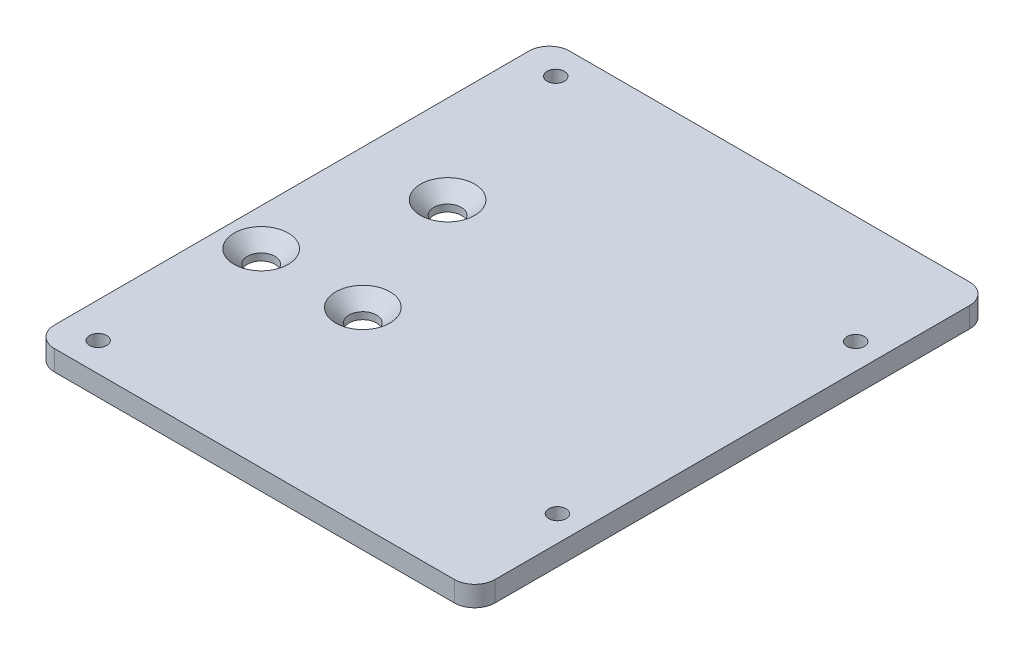
ISO-10303-21;
HEADER;
FILE_DESCRIPTION(('STEP AP214'),'2;1');
FILE_NAME('part.step','',(''),(''),'','','');
FILE_SCHEMA(('AUTOMOTIVE_DESIGN { 1 0 10303 214 1 1 1 1 }'));
ENDSEC;
DATA;
#1=APPLICATION_CONTEXT('core data for automotive mechanical design processes');
#2=APPLICATION_PROTOCOL_DEFINITION('international standard','automotive_design',2000,#1);
#3=PRODUCT_CONTEXT('',#1,'mechanical');
#4=PRODUCT('Part','Part','',(#3));
#5=PRODUCT_RELATED_PRODUCT_CATEGORY('part','',(#4));
#6=PRODUCT_DEFINITION_FORMATION('','',#4);
#7=PRODUCT_DEFINITION_CONTEXT('part definition',#1,'design');
#8=PRODUCT_DEFINITION('design','',#6,#7);
#9=PRODUCT_DEFINITION_SHAPE('','',#8);
#10=(LENGTH_UNIT() NAMED_UNIT(*) SI_UNIT(.MILLI.,.METRE.));
#11=(NAMED_UNIT(*) PLANE_ANGLE_UNIT() SI_UNIT($,.RADIAN.));
#12=(NAMED_UNIT(*) SI_UNIT($,.STERADIAN.) SOLID_ANGLE_UNIT());
#13=UNCERTAINTY_MEASURE_WITH_UNIT(LENGTH_MEASURE(1.E-05),#10,'distance_accuracy_value','');
#14=(GEOMETRIC_REPRESENTATION_CONTEXT(3) GLOBAL_UNCERTAINTY_ASSIGNED_CONTEXT((#13)) GLOBAL_UNIT_ASSIGNED_CONTEXT((#10,
#11,#12)) REPRESENTATION_CONTEXT('',''));
#15=CARTESIAN_POINT('',(0.,0.,0.));
#16=DIRECTION('',(0.,0.,1.));
#17=DIRECTION('',(1.,0.,0.));
#18=AXIS2_PLACEMENT_3D('',#15,#16,#17);
#19=CARTESIAN_POINT('',(32.5,3.,38.));
#20=DIRECTION('',(-1.,0.,0.));
#21=DIRECTION('',(0.,0.,1.));
#22=AXIS2_PLACEMENT_3D('',#19,#20,#21);
#23=PLANE('',#22);
#24=DIRECTION('',(0.,0.,-1.));
#25=VECTOR('',#24,1.);
#26=CARTESIAN_POINT('',(32.5,0.,38.));
#27=LINE('',#26,#25);
#28=CARTESIAN_POINT('',(32.5,0.,35.));
#29=VERTEX_POINT('',#28);
#30=CARTESIAN_POINT('',(32.5,0.,-35.));
#31=VERTEX_POINT('',#30);
#32=EDGE_CURVE('E208',#29,#31,#27,.T.);
#33=ORIENTED_EDGE('',*,*,#32,.T.);
#34=DIRECTION('',(0.,-1.,0.));
#35=VECTOR('',#34,1.);
#36=CARTESIAN_POINT('',(32.5,3.,-35.));
#37=LINE('',#36,#35);
#38=CARTESIAN_POINT('',(32.5,3.,-35.));
#39=VERTEX_POINT('',#38);
#40=EDGE_CURVE('E11',#31,#39,#37,.F.);
#41=ORIENTED_EDGE('',*,*,#40,.T.);
#42=DIRECTION('',(0.,0.,-1.));
#43=VECTOR('',#42,1.);
#44=CARTESIAN_POINT('',(32.5,3.,38.));
#45=LINE('',#44,#43);
#46=CARTESIAN_POINT('',(32.5,3.,35.));
#47=VERTEX_POINT('',#46);
#48=EDGE_CURVE('E129',#47,#39,#45,.T.);
#49=ORIENTED_EDGE('',*,*,#48,.F.);
#50=DIRECTION('',(0.,-1.,0.));
#51=VECTOR('',#50,1.);
#52=CARTESIAN_POINT('',(32.5,3.,35.));
#53=LINE('',#52,#51);
#54=EDGE_CURVE('E44',#47,#29,#53,.T.);
#55=ORIENTED_EDGE('',*,*,#54,.T.);
#56=EDGE_LOOP('',(#33,#41,#49,#55));
#57=FACE_BOUND('',#56,.T.);
#58=ADVANCED_FACE('F35',(#57),#23,.F.);
#59=CARTESIAN_POINT('',(-32.5,3.,-38.));
#60=DIRECTION('',(0.,0.,1.));
#61=DIRECTION('',(1.,0.,0.));
#62=AXIS2_PLACEMENT_3D('',#59,#60,#61);
#63=PLANE('',#62);
#64=DIRECTION('',(-1.,0.,0.));
#65=VECTOR('',#64,1.);
#66=CARTESIAN_POINT('',(-32.5,0.,-38.));
#67=LINE('',#66,#65);
#68=CARTESIAN_POINT('',(29.5,0.,-38.));
#69=VERTEX_POINT('',#68);
#70=CARTESIAN_POINT('',(-29.5,0.,-38.));
#71=VERTEX_POINT('',#70);
#72=EDGE_CURVE('E134',#69,#71,#67,.T.);
#73=ORIENTED_EDGE('',*,*,#72,.T.);
#74=DIRECTION('',(0.,-1.,0.));
#75=VECTOR('',#74,1.);
#76=CARTESIAN_POINT('',(-29.5,3.,-38.));
#77=LINE('',#76,#75);
#78=CARTESIAN_POINT('',(-29.5,3.,-38.));
#79=VERTEX_POINT('',#78);
#80=EDGE_CURVE('E52',#71,#79,#77,.F.);
#81=ORIENTED_EDGE('',*,*,#80,.T.);
#82=DIRECTION('',(-1.,0.,0.));
#83=VECTOR('',#82,1.);
#84=CARTESIAN_POINT('',(-32.5,3.,-38.));
#85=LINE('',#84,#83);
#86=CARTESIAN_POINT('',(29.5,3.,-38.));
#87=VERTEX_POINT('',#86);
#88=EDGE_CURVE('E132',#87,#79,#85,.T.);
#89=ORIENTED_EDGE('',*,*,#88,.F.);
#90=DIRECTION('',(0.,-1.,0.));
#91=VECTOR('',#90,1.);
#92=CARTESIAN_POINT('',(29.5,3.,-38.));
#93=LINE('',#92,#91);
#94=EDGE_CURVE('E153',#87,#69,#93,.T.);
#95=ORIENTED_EDGE('',*,*,#94,.T.);
#96=EDGE_LOOP('',(#73,#81,#89,#95));
#97=FACE_BOUND('',#96,.T.);
#98=ADVANCED_FACE('F218',(#97),#63,.F.);
#99=CARTESIAN_POINT('',(-32.5,3.,38.));
#100=DIRECTION('',(1.,0.,0.));
#101=DIRECTION('',(0.,0.,-1.));
#102=AXIS2_PLACEMENT_3D('',#99,#100,#101);
#103=PLANE('',#102);
#104=DIRECTION('',(0.,0.,1.));
#105=VECTOR('',#104,1.);
#106=CARTESIAN_POINT('',(-32.5,0.,38.));
#107=LINE('',#106,#105);
#108=CARTESIAN_POINT('',(-32.5,0.,-35.));
#109=VERTEX_POINT('',#108);
#110=CARTESIAN_POINT('',(-32.5,0.,35.));
#111=VERTEX_POINT('',#110);
#112=EDGE_CURVE('E130',#109,#111,#107,.T.);
#113=ORIENTED_EDGE('',*,*,#112,.T.);
#114=DIRECTION('',(0.,-1.,0.));
#115=VECTOR('',#114,1.);
#116=CARTESIAN_POINT('',(-32.5,3.,35.));
#117=LINE('',#116,#115);
#118=CARTESIAN_POINT('',(-32.5,3.,35.));
#119=VERTEX_POINT('',#118);
#120=EDGE_CURVE('E108',#111,#119,#117,.F.);
#121=ORIENTED_EDGE('',*,*,#120,.T.);
#122=DIRECTION('',(0.,0.,1.));
#123=VECTOR('',#122,1.);
#124=CARTESIAN_POINT('',(-32.5,3.,38.));
#125=LINE('',#124,#123);
#126=CARTESIAN_POINT('',(-32.5,3.,-35.));
#127=VERTEX_POINT('',#126);
#128=EDGE_CURVE('E212',#127,#119,#125,.T.);
#129=ORIENTED_EDGE('',*,*,#128,.F.);
#130=DIRECTION('',(0.,-1.,0.));
#131=VECTOR('',#130,1.);
#132=CARTESIAN_POINT('',(-32.5,3.,-35.));
#133=LINE('',#132,#131);
#134=EDGE_CURVE('E113',#127,#109,#133,.T.);
#135=ORIENTED_EDGE('',*,*,#134,.T.);
#136=EDGE_LOOP('',(#113,#121,#129,#135));
#137=FACE_BOUND('',#136,.T.);
#138=ADVANCED_FACE('F227',(#137),#103,.F.);
#139=CARTESIAN_POINT('',(-32.5,3.,38.));
#140=DIRECTION('',(0.,0.,-1.));
#141=DIRECTION('',(-1.,0.,0.));
#142=AXIS2_PLACEMENT_3D('',#139,#140,#141);
#143=PLANE('',#142);
#144=DIRECTION('',(1.,0.,0.));
#145=VECTOR('',#144,1.);
#146=CARTESIAN_POINT('',(-32.5,3.,38.));
#147=LINE('',#146,#145);
#148=CARTESIAN_POINT('',(-29.5,3.,38.));
#149=VERTEX_POINT('',#148);
#150=CARTESIAN_POINT('',(29.5,3.,38.));
#151=VERTEX_POINT('',#150);
#152=EDGE_CURVE('E123',#149,#151,#147,.T.);
#153=ORIENTED_EDGE('',*,*,#152,.F.);
#154=DIRECTION('',(0.,-1.,0.));
#155=VECTOR('',#154,1.);
#156=CARTESIAN_POINT('',(-29.5,3.,38.));
#157=LINE('',#156,#155);
#158=CARTESIAN_POINT('',(-29.5,0.,38.));
#159=VERTEX_POINT('',#158);
#160=EDGE_CURVE('E107',#149,#159,#157,.T.);
#161=ORIENTED_EDGE('',*,*,#160,.T.);
#162=DIRECTION('',(1.,0.,0.));
#163=VECTOR('',#162,1.);
#164=CARTESIAN_POINT('',(-32.5,0.,38.));
#165=LINE('',#164,#163);
#166=CARTESIAN_POINT('',(29.5,0.,38.));
#167=VERTEX_POINT('',#166);
#168=EDGE_CURVE('E120',#159,#167,#165,.T.);
#169=ORIENTED_EDGE('',*,*,#168,.T.);
#170=DIRECTION('',(0.,-1.,0.));
#171=VECTOR('',#170,1.);
#172=CARTESIAN_POINT('',(29.5,3.,38.));
#173=LINE('',#172,#171);
#174=EDGE_CURVE('E125',#167,#151,#173,.F.);
#175=ORIENTED_EDGE('',*,*,#174,.T.);
#176=EDGE_LOOP('',(#153,#161,#169,#175));
#177=FACE_BOUND('',#176,.T.);
#178=ADVANCED_FACE('F119',(#177),#143,.F.);
#179=CARTESIAN_POINT('',(0.,3.,0.));
#180=DIRECTION('',(0.,-1.,0.));
#181=DIRECTION('',(0.,0.,-1.));
#182=AXIS2_PLACEMENT_3D('',#179,#180,#181);
#183=PLANE('',#182);
#184=CARTESIAN_POINT('',(-12.,3.,9.99999999999997));
#185=DIRECTION('',(0.,1.,0.));
#186=DIRECTION('',(0.,0.,1.));
#187=AXIS2_PLACEMENT_3D('',#184,#185,#186);
#188=CIRCLE('',#187,4.);
#189=CARTESIAN_POINT('',(-12.,3.,14.));
#190=VERTEX_POINT('',#189);
#191=EDGE_CURVE('E184',#190,#190,#188,.T.);
#192=ORIENTED_EDGE('',*,*,#191,.F.);
#193=EDGE_LOOP('',(#192));
#194=FACE_BOUND('',#193,.T.);
#195=CARTESIAN_POINT('',(-27.,3.,9.99999999999997));
#196=DIRECTION('',(0.,1.,0.));
#197=DIRECTION('',(0.,0.,1.));
#198=AXIS2_PLACEMENT_3D('',#195,#196,#197);
#199=CIRCLE('',#198,4.);
#200=CARTESIAN_POINT('',(-27.,3.,14.));
#201=VERTEX_POINT('',#200);
#202=EDGE_CURVE('E174',#201,#201,#199,.T.);
#203=ORIENTED_EDGE('',*,*,#202,.F.);
#204=EDGE_LOOP('',(#203));
#205=FACE_BOUND('',#204,.T.);
#206=CARTESIAN_POINT('',(-19.5,3.,-10.));
#207=DIRECTION('',(0.,1.,0.));
#208=DIRECTION('',(0.,0.,1.));
#209=AXIS2_PLACEMENT_3D('',#206,#207,#208);
#210=CIRCLE('',#209,4.);
#211=CARTESIAN_POINT('',(-19.5,3.,-6.00000000000002));
#212=VERTEX_POINT('',#211);
#213=EDGE_CURVE('E171',#212,#212,#210,.T.);
#214=ORIENTED_EDGE('',*,*,#213,.F.);
#215=EDGE_LOOP('',(#214));
#216=FACE_BOUND('',#215,.T.);
#217=CARTESIAN_POINT('',(-27.3,3.,33.75));
#218=DIRECTION('',(0.,1.,0.));
#219=DIRECTION('',(0.,0.,1.));
#220=AXIS2_PLACEMENT_3D('',#217,#218,#219);
#221=CIRCLE('',#220,1.275);
#222=CARTESIAN_POINT('',(-27.3,3.,35.025));
#223=VERTEX_POINT('',#222);
#224=EDGE_CURVE('E169',#223,#223,#221,.T.);
#225=ORIENTED_EDGE('',*,*,#224,.F.);
#226=EDGE_LOOP('',(#225));
#227=FACE_BOUND('',#226,.T.);
#228=CARTESIAN_POINT('',(-27.3,3.,-33.75));
#229=DIRECTION('',(0.,1.,0.));
#230=DIRECTION('',(0.,0.,1.));
#231=AXIS2_PLACEMENT_3D('',#228,#229,#230);
#232=CIRCLE('',#231,1.275);
#233=CARTESIAN_POINT('',(-27.3,3.,-32.475));
#234=VERTEX_POINT('',#233);
#235=EDGE_CURVE('E197',#234,#234,#232,.T.);
#236=ORIENTED_EDGE('',*,*,#235,.F.);
#237=EDGE_LOOP('',(#236));
#238=FACE_BOUND('',#237,.T.);
#239=CARTESIAN_POINT('',(28.7,3.,-22.));
#240=DIRECTION('',(0.,1.,0.));
#241=DIRECTION('',(0.,0.,1.));
#242=AXIS2_PLACEMENT_3D('',#239,#240,#241);
#243=CIRCLE('',#242,1.275);
#244=CARTESIAN_POINT('',(28.7,3.,-20.725));
#245=VERTEX_POINT('',#244);
#246=EDGE_CURVE('E191',#245,#245,#243,.T.);
#247=ORIENTED_EDGE('',*,*,#246,.F.);
#248=EDGE_LOOP('',(#247));
#249=FACE_BOUND('',#248,.T.);
#250=CARTESIAN_POINT('',(28.7,3.,22.));
#251=DIRECTION('',(0.,1.,0.));
#252=DIRECTION('',(0.,0.,1.));
#253=AXIS2_PLACEMENT_3D('',#250,#251,#252);
#254=CIRCLE('',#253,1.275);
#255=CARTESIAN_POINT('',(28.7,3.,23.275));
#256=VERTEX_POINT('',#255);
#257=EDGE_CURVE('E190',#256,#256,#254,.T.);
#258=ORIENTED_EDGE('',*,*,#257,.F.);
#259=EDGE_LOOP('',(#258));
#260=FACE_BOUND('',#259,.T.);
#261=ORIENTED_EDGE('',*,*,#128,.T.);
#262=CARTESIAN_POINT('',(-29.5,3.,35.));
#263=DIRECTION('',(0.,-1.,0.));
#264=DIRECTION('',(0.,0.,-1.));
#265=AXIS2_PLACEMENT_3D('',#262,#263,#264);
#266=CIRCLE('',#265,3.);
#267=EDGE_CURVE('E151',#119,#149,#266,.F.);
#268=ORIENTED_EDGE('',*,*,#267,.T.);
#269=ORIENTED_EDGE('',*,*,#152,.T.);
#270=CARTESIAN_POINT('',(29.5,3.,35.));
#271=DIRECTION('',(0.,-1.,0.));
#272=DIRECTION('',(0.,0.,-1.));
#273=AXIS2_PLACEMENT_3D('',#270,#271,#272);
#274=CIRCLE('',#273,3.);
#275=EDGE_CURVE('E146',#151,#47,#274,.F.);
#276=ORIENTED_EDGE('',*,*,#275,.T.);
#277=ORIENTED_EDGE('',*,*,#48,.T.);
#278=CARTESIAN_POINT('',(29.5,3.,-35.));
#279=DIRECTION('',(0.,-1.,0.));
#280=DIRECTION('',(0.,0.,-1.));
#281=AXIS2_PLACEMENT_3D('',#278,#279,#280);
#282=CIRCLE('',#281,3.);
#283=EDGE_CURVE('E59',#39,#87,#282,.F.);
#284=ORIENTED_EDGE('',*,*,#283,.T.);
#285=ORIENTED_EDGE('',*,*,#88,.T.);
#286=CARTESIAN_POINT('',(-29.5,3.,-35.));
#287=DIRECTION('',(0.,-1.,0.));
#288=DIRECTION('',(0.,0.,-1.));
#289=AXIS2_PLACEMENT_3D('',#286,#287,#288);
#290=CIRCLE('',#289,3.);
#291=EDGE_CURVE('E149',#79,#127,#290,.F.);
#292=ORIENTED_EDGE('',*,*,#291,.T.);
#293=EDGE_LOOP('',(#261,#268,#269,#276,#277,#284,#285,#292));
#294=FACE_BOUND('',#293,.T.);
#295=ADVANCED_FACE('F225',(#194,#205,#216,#227,#238,#249,#260,#294),#183,.F.);
#296=CARTESIAN_POINT('',(0.,0.,0.));
#297=DIRECTION('',(0.,-1.,0.));
#298=DIRECTION('',(0.,0.,-1.));
#299=AXIS2_PLACEMENT_3D('',#296,#297,#298);
#300=PLANE('',#299);
#301=CARTESIAN_POINT('',(-27.,0.,9.99999999999997));
#302=DIRECTION('',(0.,-1.,0.));
#303=DIRECTION('',(0.,0.,-1.));
#304=AXIS2_PLACEMENT_3D('',#301,#302,#303);
#305=CIRCLE('',#304,2.025);
#306=CARTESIAN_POINT('',(-27.,0.,7.97499999999997));
#307=VERTEX_POINT('',#306);
#308=EDGE_CURVE('E166',#307,#307,#305,.T.);
#309=ORIENTED_EDGE('',*,*,#308,.F.);
#310=EDGE_LOOP('',(#309));
#311=FACE_BOUND('',#310,.T.);
#312=CARTESIAN_POINT('',(-12.,0.,9.99999999999997));
#313=DIRECTION('',(0.,-1.,0.));
#314=DIRECTION('',(0.,0.,-1.));
#315=AXIS2_PLACEMENT_3D('',#312,#313,#314);
#316=CIRCLE('',#315,2.025);
#317=CARTESIAN_POINT('',(-12.,0.,7.97499999999997));
#318=VERTEX_POINT('',#317);
#319=EDGE_CURVE('E162',#318,#318,#316,.T.);
#320=ORIENTED_EDGE('',*,*,#319,.F.);
#321=EDGE_LOOP('',(#320));
#322=FACE_BOUND('',#321,.T.);
#323=CARTESIAN_POINT('',(-19.5,0.,-10.));
#324=DIRECTION('',(0.,-1.,0.));
#325=DIRECTION('',(0.,0.,-1.));
#326=AXIS2_PLACEMENT_3D('',#323,#324,#325);
#327=CIRCLE('',#326,2.025);
#328=CARTESIAN_POINT('',(-19.5,0.,-12.025));
#329=VERTEX_POINT('',#328);
#330=EDGE_CURVE('E159',#329,#329,#327,.T.);
#331=ORIENTED_EDGE('',*,*,#330,.F.);
#332=EDGE_LOOP('',(#331));
#333=FACE_BOUND('',#332,.T.);
#334=CARTESIAN_POINT('',(-27.3,0.,33.75));
#335=DIRECTION('',(0.,1.,0.));
#336=DIRECTION('',(0.,0.,1.));
#337=AXIS2_PLACEMENT_3D('',#334,#335,#336);
#338=CIRCLE('',#337,1.275);
#339=CARTESIAN_POINT('',(-27.3,0.,35.025));
#340=VERTEX_POINT('',#339);
#341=EDGE_CURVE('E200',#340,#340,#338,.T.);
#342=ORIENTED_EDGE('',*,*,#341,.T.);
#343=EDGE_LOOP('',(#342));
#344=FACE_BOUND('',#343,.T.);
#345=CARTESIAN_POINT('',(-27.3,0.,-33.75));
#346=DIRECTION('',(0.,1.,0.));
#347=DIRECTION('',(0.,0.,1.));
#348=AXIS2_PLACEMENT_3D('',#345,#346,#347);
#349=CIRCLE('',#348,1.275);
#350=CARTESIAN_POINT('',(-27.3,0.,-32.475));
#351=VERTEX_POINT('',#350);
#352=EDGE_CURVE('E194',#351,#351,#349,.T.);
#353=ORIENTED_EDGE('',*,*,#352,.T.);
#354=EDGE_LOOP('',(#353));
#355=FACE_BOUND('',#354,.T.);
#356=CARTESIAN_POINT('',(28.7,0.,-22.));
#357=DIRECTION('',(0.,1.,0.));
#358=DIRECTION('',(0.,0.,1.));
#359=AXIS2_PLACEMENT_3D('',#356,#357,#358);
#360=CIRCLE('',#359,1.275);
#361=CARTESIAN_POINT('',(28.7,0.,-20.725));
#362=VERTEX_POINT('',#361);
#363=EDGE_CURVE('E187',#362,#362,#360,.T.);
#364=ORIENTED_EDGE('',*,*,#363,.T.);
#365=EDGE_LOOP('',(#364));
#366=FACE_BOUND('',#365,.T.);
#367=CARTESIAN_POINT('',(28.7,0.,22.));
#368=DIRECTION('',(0.,1.,0.));
#369=DIRECTION('',(0.,0.,1.));
#370=AXIS2_PLACEMENT_3D('',#367,#368,#369);
#371=CIRCLE('',#370,1.275);
#372=CARTESIAN_POINT('',(28.7,0.,23.275));
#373=VERTEX_POINT('',#372);
#374=EDGE_CURVE('E205',#373,#373,#371,.T.);
#375=ORIENTED_EDGE('',*,*,#374,.T.);
#376=EDGE_LOOP('',(#375));
#377=FACE_BOUND('',#376,.T.);
#378=ORIENTED_EDGE('',*,*,#168,.F.);
#379=CARTESIAN_POINT('',(-29.5,0.,35.));
#380=DIRECTION('',(0.,-1.,0.));
#381=DIRECTION('',(0.,0.,-1.));
#382=AXIS2_PLACEMENT_3D('',#379,#380,#381);
#383=CIRCLE('',#382,3.);
#384=EDGE_CURVE('E103',#159,#111,#383,.T.);
#385=ORIENTED_EDGE('',*,*,#384,.T.);
#386=ORIENTED_EDGE('',*,*,#112,.F.);
#387=CARTESIAN_POINT('',(-29.5,0.,-35.));
#388=DIRECTION('',(0.,-1.,0.));
#389=DIRECTION('',(0.,0.,-1.));
#390=AXIS2_PLACEMENT_3D('',#387,#388,#389);
#391=CIRCLE('',#390,3.);
#392=EDGE_CURVE('E114',#109,#71,#391,.T.);
#393=ORIENTED_EDGE('',*,*,#392,.T.);
#394=ORIENTED_EDGE('',*,*,#72,.F.);
#395=CARTESIAN_POINT('',(29.5,0.,-35.));
#396=DIRECTION('',(0.,-1.,0.));
#397=DIRECTION('',(0.,0.,-1.));
#398=AXIS2_PLACEMENT_3D('',#395,#396,#397);
#399=CIRCLE('',#398,3.);
#400=EDGE_CURVE('E140',#69,#31,#399,.T.);
#401=ORIENTED_EDGE('',*,*,#400,.T.);
#402=ORIENTED_EDGE('',*,*,#32,.F.);
#403=CARTESIAN_POINT('',(29.5,0.,35.));
#404=DIRECTION('',(0.,-1.,0.));
#405=DIRECTION('',(0.,0.,-1.));
#406=AXIS2_PLACEMENT_3D('',#403,#404,#405);
#407=CIRCLE('',#406,3.);
#408=EDGE_CURVE('E124',#29,#167,#407,.T.);
#409=ORIENTED_EDGE('',*,*,#408,.T.);
#410=EDGE_LOOP('',(#378,#385,#386,#393,#394,#401,#402,#409));
#411=FACE_BOUND('',#410,.T.);
#412=ADVANCED_FACE('F127',(#311,#322,#333,#344,#355,#366,#377,#411),#300,.T.);
#413=CARTESIAN_POINT('',(-29.5,3.,35.));
#414=DIRECTION('',(0.,-1.,0.));
#415=DIRECTION('',(0.,0.,-1.));
#416=AXIS2_PLACEMENT_3D('',#413,#414,#415);
#417=CYLINDRICAL_SURFACE('',#416,3.);
#418=ORIENTED_EDGE('',*,*,#267,.F.);
#419=ORIENTED_EDGE('',*,*,#120,.F.);
#420=ORIENTED_EDGE('',*,*,#384,.F.);
#421=ORIENTED_EDGE('',*,*,#160,.F.);
#422=EDGE_LOOP('',(#418,#419,#420,#421));
#423=FACE_BOUND('',#422,.T.);
#424=ADVANCED_FACE('F106',(#423),#417,.T.);
#425=CARTESIAN_POINT('',(-29.5,3.,-35.));
#426=DIRECTION('',(0.,-1.,0.));
#427=DIRECTION('',(0.,0.,-1.));
#428=AXIS2_PLACEMENT_3D('',#425,#426,#427);
#429=CYLINDRICAL_SURFACE('',#428,3.);
#430=ORIENTED_EDGE('',*,*,#291,.F.);
#431=ORIENTED_EDGE('',*,*,#80,.F.);
#432=ORIENTED_EDGE('',*,*,#392,.F.);
#433=ORIENTED_EDGE('',*,*,#134,.F.);
#434=EDGE_LOOP('',(#430,#431,#432,#433));
#435=FACE_BOUND('',#434,.T.);
#436=ADVANCED_FACE('F222',(#435),#429,.T.);
#437=CARTESIAN_POINT('',(29.5,3.,-35.));
#438=DIRECTION('',(0.,-1.,0.));
#439=DIRECTION('',(0.,0.,-1.));
#440=AXIS2_PLACEMENT_3D('',#437,#438,#439);
#441=CYLINDRICAL_SURFACE('',#440,3.);
#442=ORIENTED_EDGE('',*,*,#283,.F.);
#443=ORIENTED_EDGE('',*,*,#40,.F.);
#444=ORIENTED_EDGE('',*,*,#400,.F.);
#445=ORIENTED_EDGE('',*,*,#94,.F.);
#446=EDGE_LOOP('',(#442,#443,#444,#445));
#447=FACE_BOUND('',#446,.T.);
#448=ADVANCED_FACE('F245',(#447),#441,.T.);
#449=CARTESIAN_POINT('',(29.5,3.,35.));
#450=DIRECTION('',(0.,-1.,0.));
#451=DIRECTION('',(0.,0.,-1.));
#452=AXIS2_PLACEMENT_3D('',#449,#450,#451);
#453=CYLINDRICAL_SURFACE('',#452,3.);
#454=ORIENTED_EDGE('',*,*,#275,.F.);
#455=ORIENTED_EDGE('',*,*,#174,.F.);
#456=ORIENTED_EDGE('',*,*,#408,.F.);
#457=ORIENTED_EDGE('',*,*,#54,.F.);
#458=EDGE_LOOP('',(#454,#455,#456,#457));
#459=FACE_BOUND('',#458,.T.);
#460=ADVANCED_FACE('F37',(#459),#453,.T.);
#461=CARTESIAN_POINT('',(28.7,0.,22.));
#462=DIRECTION('',(0.,1.,0.));
#463=DIRECTION('',(0.,0.,1.));
#464=AXIS2_PLACEMENT_3D('',#461,#462,#463);
#465=CYLINDRICAL_SURFACE('',#464,1.275);
#466=ORIENTED_EDGE('',*,*,#374,.F.);
#467=EDGE_LOOP('',(#466));
#468=FACE_BOUND('',#467,.T.);
#469=ORIENTED_EDGE('',*,*,#257,.T.);
#470=EDGE_LOOP('',(#469));
#471=FACE_BOUND('',#470,.T.);
#472=ADVANCED_FACE('F251',(#468,#471),#465,.F.);
#473=CARTESIAN_POINT('',(28.7,0.,-22.));
#474=DIRECTION('',(0.,1.,0.));
#475=DIRECTION('',(0.,0.,1.));
#476=AXIS2_PLACEMENT_3D('',#473,#474,#475);
#477=CYLINDRICAL_SURFACE('',#476,1.275);
#478=ORIENTED_EDGE('',*,*,#363,.F.);
#479=EDGE_LOOP('',(#478));
#480=FACE_BOUND('',#479,.T.);
#481=ORIENTED_EDGE('',*,*,#246,.T.);
#482=EDGE_LOOP('',(#481));
#483=FACE_BOUND('',#482,.T.);
#484=ADVANCED_FACE('F260',(#480,#483),#477,.F.);
#485=CARTESIAN_POINT('',(-27.3,0.,-33.75));
#486=DIRECTION('',(0.,1.,0.));
#487=DIRECTION('',(0.,0.,1.));
#488=AXIS2_PLACEMENT_3D('',#485,#486,#487);
#489=CYLINDRICAL_SURFACE('',#488,1.275);
#490=ORIENTED_EDGE('',*,*,#352,.F.);
#491=EDGE_LOOP('',(#490));
#492=FACE_BOUND('',#491,.T.);
#493=ORIENTED_EDGE('',*,*,#235,.T.);
#494=EDGE_LOOP('',(#493));
#495=FACE_BOUND('',#494,.T.);
#496=ADVANCED_FACE('F266',(#492,#495),#489,.F.);
#497=CARTESIAN_POINT('',(-27.3,0.,33.75));
#498=DIRECTION('',(0.,1.,0.));
#499=DIRECTION('',(0.,0.,1.));
#500=AXIS2_PLACEMENT_3D('',#497,#498,#499);
#501=CYLINDRICAL_SURFACE('',#500,1.275);
#502=ORIENTED_EDGE('',*,*,#341,.F.);
#503=EDGE_LOOP('',(#502));
#504=FACE_BOUND('',#503,.T.);
#505=ORIENTED_EDGE('',*,*,#224,.T.);
#506=EDGE_LOOP('',(#505));
#507=FACE_BOUND('',#506,.T.);
#508=ADVANCED_FACE('F273',(#504,#507),#501,.F.);
#509=CARTESIAN_POINT('',(-19.5,-7.,-10.));
#510=DIRECTION('',(0.,1.,0.));
#511=DIRECTION('',(0.,0.,1.));
#512=AXIS2_PLACEMENT_3D('',#509,#510,#511);
#513=CYLINDRICAL_SURFACE('',#512,2.025);
#514=CARTESIAN_POINT('',(-19.5,1.025,-10.));
#515=DIRECTION('',(0.,1.,0.));
#516=DIRECTION('',(0.,0.,1.));
#517=AXIS2_PLACEMENT_3D('',#514,#515,#516);
#518=CIRCLE('',#517,2.025);
#519=CARTESIAN_POINT('',(-19.5,1.025,-7.97500000000003));
#520=VERTEX_POINT('',#519);
#521=EDGE_CURVE('E163',#520,#520,#518,.T.);
#522=ORIENTED_EDGE('',*,*,#521,.T.);
#523=EDGE_LOOP('',(#522));
#524=FACE_BOUND('',#523,.T.);
#525=ORIENTED_EDGE('',*,*,#330,.T.);
#526=EDGE_LOOP('',(#525));
#527=FACE_BOUND('',#526,.T.);
#528=ADVANCED_FACE('F307',(#524,#527),#513,.F.);
#529=CARTESIAN_POINT('',(-12.,-7.,9.99999999999997));
#530=DIRECTION('',(0.,1.,0.));
#531=DIRECTION('',(0.,0.,1.));
#532=AXIS2_PLACEMENT_3D('',#529,#530,#531);
#533=CYLINDRICAL_SURFACE('',#532,2.025);
#534=CARTESIAN_POINT('',(-12.,1.02500000000001,9.99999999999997));
#535=DIRECTION('',(0.,1.,0.));
#536=DIRECTION('',(0.,0.,1.));
#537=AXIS2_PLACEMENT_3D('',#534,#535,#536);
#538=CIRCLE('',#537,2.025);
#539=CARTESIAN_POINT('',(-12.,1.02500000000001,12.025));
#540=VERTEX_POINT('',#539);
#541=EDGE_CURVE('E39',#540,#540,#538,.T.);
#542=ORIENTED_EDGE('',*,*,#541,.T.);
#543=EDGE_LOOP('',(#542));
#544=FACE_BOUND('',#543,.T.);
#545=ORIENTED_EDGE('',*,*,#319,.T.);
#546=EDGE_LOOP('',(#545));
#547=FACE_BOUND('',#546,.T.);
#548=ADVANCED_FACE('F312',(#544,#547),#533,.F.);
#549=CARTESIAN_POINT('',(-27.,-7.,9.99999999999997));
#550=DIRECTION('',(0.,1.,0.));
#551=DIRECTION('',(0.,0.,1.));
#552=AXIS2_PLACEMENT_3D('',#549,#550,#551);
#553=CYLINDRICAL_SURFACE('',#552,2.025);
#554=CARTESIAN_POINT('',(-27.,1.025,9.99999999999997));
#555=DIRECTION('',(0.,1.,0.));
#556=DIRECTION('',(0.,0.,1.));
#557=AXIS2_PLACEMENT_3D('',#554,#555,#556);
#558=CIRCLE('',#557,2.025);
#559=CARTESIAN_POINT('',(-27.,1.025,12.025));
#560=VERTEX_POINT('',#559);
#561=EDGE_CURVE('E172',#560,#560,#558,.T.);
#562=ORIENTED_EDGE('',*,*,#561,.T.);
#563=EDGE_LOOP('',(#562));
#564=FACE_BOUND('',#563,.T.);
#565=ORIENTED_EDGE('',*,*,#308,.T.);
#566=EDGE_LOOP('',(#565));
#567=FACE_BOUND('',#566,.T.);
#568=ADVANCED_FACE('F316',(#564,#567),#553,.F.);
#569=CARTESIAN_POINT('',(-19.5,3.,-10.));
#570=DIRECTION('',(0.,1.,0.));
#571=DIRECTION('',(0.,0.,1.));
#572=AXIS2_PLACEMENT_3D('',#569,#570,#571);
#573=CONICAL_SURFACE('',#572,4.,0.78539816339745);
#574=ORIENTED_EDGE('',*,*,#213,.T.);
#575=EDGE_LOOP('',(#574));
#576=FACE_BOUND('',#575,.T.);
#577=ORIENTED_EDGE('',*,*,#521,.F.);
#578=EDGE_LOOP('',(#577));
#579=FACE_BOUND('',#578,.T.);
#580=ADVANCED_FACE('F320',(#576,#579),#573,.F.);
#581=CARTESIAN_POINT('',(-27.,3.,9.99999999999997));
#582=DIRECTION('',(0.,1.,0.));
#583=DIRECTION('',(0.,0.,1.));
#584=AXIS2_PLACEMENT_3D('',#581,#582,#583);
#585=CONICAL_SURFACE('',#584,4.,0.78539816339745);
#586=ORIENTED_EDGE('',*,*,#202,.T.);
#587=EDGE_LOOP('',(#586));
#588=FACE_BOUND('',#587,.T.);
#589=ORIENTED_EDGE('',*,*,#561,.F.);
#590=EDGE_LOOP('',(#589));
#591=FACE_BOUND('',#590,.T.);
#592=ADVANCED_FACE('F323',(#588,#591),#585,.F.);
#593=CARTESIAN_POINT('',(-12.,3.,9.99999999999997));
#594=DIRECTION('',(0.,1.,0.));
#595=DIRECTION('',(0.,0.,1.));
#596=AXIS2_PLACEMENT_3D('',#593,#594,#595);
#597=CONICAL_SURFACE('',#596,4.,0.78539816339745);
#598=ORIENTED_EDGE('',*,*,#191,.T.);
#599=EDGE_LOOP('',(#598));
#600=FACE_BOUND('',#599,.T.);
#601=ORIENTED_EDGE('',*,*,#541,.F.);
#602=EDGE_LOOP('',(#601));
#603=FACE_BOUND('',#602,.T.);
#604=ADVANCED_FACE('F327',(#600,#603),#597,.F.);
#605=CLOSED_SHELL('',(#58,#98,#138,#178,#295,#412,#424,#436,#448,#460,#472,#484,#496,#508,#528,
#548,#568,#580,#592,#604));
#606=MANIFOLD_SOLID_BREP('B2',#605);
#607=ADVANCED_BREP_SHAPE_REPRESENTATION('',(#18,#606),#14);
#608=SHAPE_DEFINITION_REPRESENTATION(#9,#607);
ENDSEC;
END-ISO-10303-21;
